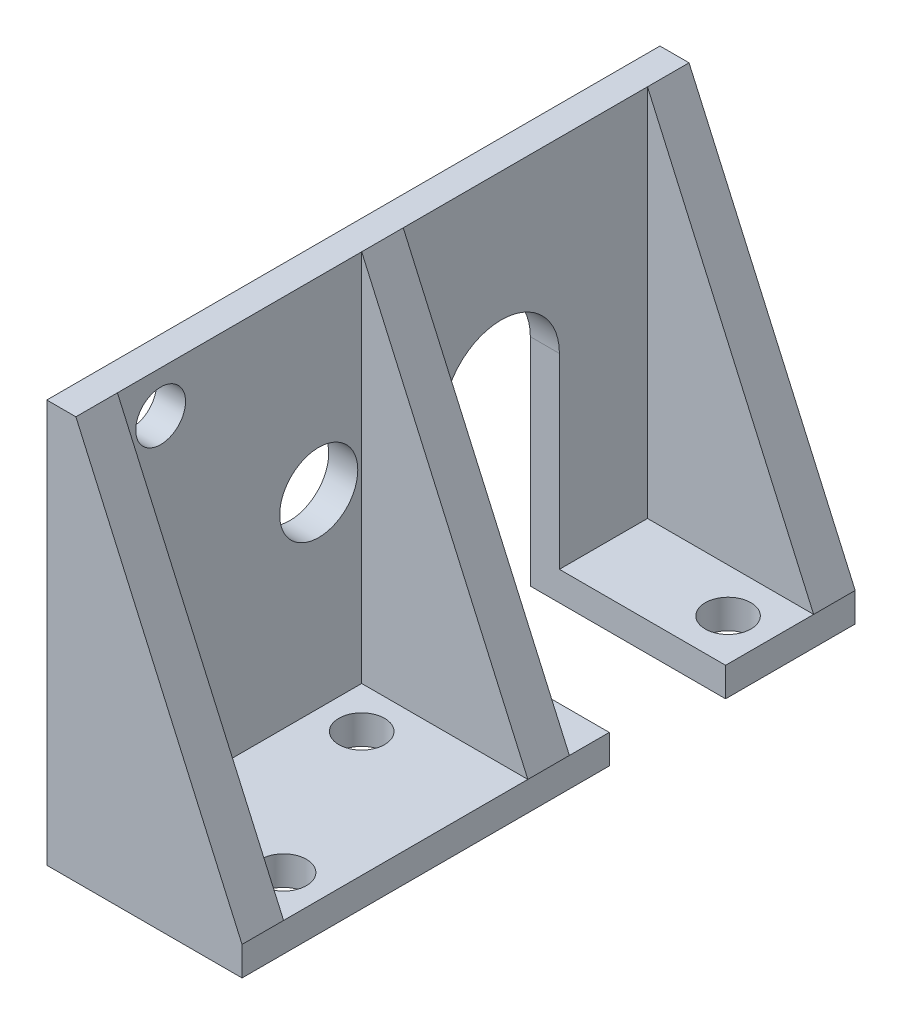
ISO-10303-21;
HEADER;
FILE_DESCRIPTION(('STEP AP214'),'2;1');
FILE_NAME('part.step','',(''),(''),'','','');
FILE_SCHEMA(('AUTOMOTIVE_DESIGN { 1 0 10303 214 1 1 1 1 }'));
ENDSEC;
DATA;
#1=APPLICATION_CONTEXT('core data for automotive mechanical design processes');
#2=APPLICATION_PROTOCOL_DEFINITION('international standard','automotive_design',2000,#1);
#3=PRODUCT_CONTEXT('',#1,'mechanical');
#4=PRODUCT('Part','Part','',(#3));
#5=PRODUCT_RELATED_PRODUCT_CATEGORY('part','',(#4));
#6=PRODUCT_DEFINITION_FORMATION('','',#4);
#7=PRODUCT_DEFINITION_CONTEXT('part definition',#1,'design');
#8=PRODUCT_DEFINITION('design','',#6,#7);
#9=PRODUCT_DEFINITION_SHAPE('','',#8);
#10=(LENGTH_UNIT() NAMED_UNIT(*) SI_UNIT(.MILLI.,.METRE.));
#11=(NAMED_UNIT(*) PLANE_ANGLE_UNIT() SI_UNIT($,.RADIAN.));
#12=(NAMED_UNIT(*) SI_UNIT($,.STERADIAN.) SOLID_ANGLE_UNIT());
#13=UNCERTAINTY_MEASURE_WITH_UNIT(LENGTH_MEASURE(1.E-05),#10,'distance_accuracy_value','');
#14=(GEOMETRIC_REPRESENTATION_CONTEXT(3) GLOBAL_UNCERTAINTY_ASSIGNED_CONTEXT((#13)) GLOBAL_UNIT_ASSIGNED_CONTEXT((#10,
#11,#12)) REPRESENTATION_CONTEXT('',''));
#15=CARTESIAN_POINT('',(0.,0.,0.));
#16=DIRECTION('',(0.,0.,1.));
#17=DIRECTION('',(1.,0.,0.));
#18=AXIS2_PLACEMENT_3D('',#15,#16,#17);
#19=CARTESIAN_POINT('',(0.,0.,0.));
#20=DIRECTION('',(0.,-1.,0.));
#21=DIRECTION('',(0.,0.,-1.));
#22=AXIS2_PLACEMENT_3D('',#19,#20,#21);
#23=PLANE('',#22);
#24=DIRECTION('',(0.,0.,1.));
#25=VECTOR('',#24,1.);
#26=CARTESIAN_POINT('',(11.75,0.,0.));
#27=LINE('',#26,#25);
#28=CARTESIAN_POINT('',(11.75,0.,-22.1));
#29=VERTEX_POINT('',#28);
#30=CARTESIAN_POINT('',(11.75,0.,-19.7));
#31=VERTEX_POINT('',#30);
#32=EDGE_CURVE('E330',#29,#31,#27,.T.);
#33=ORIENTED_EDGE('',*,*,#32,.F.);
#34=DIRECTION('',(-1.,0.,0.));
#35=VECTOR('',#34,1.);
#36=CARTESIAN_POINT('',(0.,0.,-22.1));
#37=LINE('',#36,#35);
#38=CARTESIAN_POINT('',(1.75,0.,-22.1));
#39=VERTEX_POINT('',#38);
#40=EDGE_CURVE('E226',#29,#39,#37,.T.);
#41=ORIENTED_EDGE('',*,*,#40,.T.);
#42=DIRECTION('',(0.,0.,-1.));
#43=VECTOR('',#42,1.);
#44=CARTESIAN_POINT('',(1.75,0.,0.));
#45=LINE('',#44,#43);
#46=CARTESIAN_POINT('',(1.75,0.,-19.7));
#47=VERTEX_POINT('',#46);
#48=EDGE_CURVE('E344',#47,#39,#45,.T.);
#49=ORIENTED_EDGE('',*,*,#48,.F.);
#50=DIRECTION('',(-1.,0.,0.));
#51=VECTOR('',#50,1.);
#52=CARTESIAN_POINT('',(0.,0.,-19.7));
#53=LINE('',#52,#51);
#54=EDGE_CURVE('E256',#31,#47,#53,.T.);
#55=ORIENTED_EDGE('',*,*,#54,.F.);
#56=EDGE_LOOP('',(#33,#41,#49,#55));
#57=FACE_BOUND('',#56,.T.);
#58=ADVANCED_FACE('F50',(#57),#23,.F.);
#59=CARTESIAN_POINT('',(11.75,-1.75,0.));
#60=DIRECTION('',(-1.,0.,0.));
#61=DIRECTION('',(0.,0.,1.));
#62=AXIS2_PLACEMENT_3D('',#59,#60,#61);
#63=PLANE('',#62);
#64=DIRECTION('',(0.,0.,1.));
#65=VECTOR('',#64,1.);
#66=CARTESIAN_POINT('',(11.75,-1.75,0.));
#67=LINE('',#66,#65);
#68=CARTESIAN_POINT('',(11.75,-1.75,-22.1));
#69=VERTEX_POINT('',#68);
#70=CARTESIAN_POINT('',(11.75,-1.75,0.));
#71=VERTEX_POINT('',#70);
#72=EDGE_CURVE('E315',#69,#71,#67,.T.);
#73=ORIENTED_EDGE('',*,*,#72,.F.);
#74=DIRECTION('',(0.,-1.,0.));
#75=VECTOR('',#74,1.);
#76=CARTESIAN_POINT('',(11.75,-1.75,-22.1));
#77=LINE('',#76,#75);
#78=EDGE_CURVE('E197',#29,#69,#77,.T.);
#79=ORIENTED_EDGE('',*,*,#78,.F.);
#80=ORIENTED_EDGE('',*,*,#32,.T.);
#81=CARTESIAN_POINT('',(11.75,0.,-17.2));
#82=VERTEX_POINT('',#81);
#83=EDGE_CURVE('E420',#31,#82,#27,.T.);
#84=ORIENTED_EDGE('',*,*,#83,.T.);
#85=CARTESIAN_POINT('',(11.75,0.,-2.5));
#86=VERTEX_POINT('',#85);
#87=EDGE_CURVE('E416',#82,#86,#27,.T.);
#88=ORIENTED_EDGE('',*,*,#87,.T.);
#89=CARTESIAN_POINT('',(11.75,0.,0.));
#90=VERTEX_POINT('',#89);
#91=EDGE_CURVE('E307',#86,#90,#27,.T.);
#92=ORIENTED_EDGE('',*,*,#91,.T.);
#93=DIRECTION('',(0.,1.,0.));
#94=VECTOR('',#93,1.);
#95=CARTESIAN_POINT('',(11.75,-1.75,0.));
#96=LINE('',#95,#94);
#97=EDGE_CURVE('E324',#71,#90,#96,.T.);
#98=ORIENTED_EDGE('',*,*,#97,.F.);
#99=EDGE_LOOP('',(#73,#79,#80,#84,#88,#92,#98));
#100=FACE_BOUND('',#99,.T.);
#101=ADVANCED_FACE('F386',(#100),#63,.F.);
#102=CARTESIAN_POINT('',(0.,-1.75,0.));
#103=DIRECTION('',(0.,-1.,0.));
#104=DIRECTION('',(0.,0.,-1.));
#105=AXIS2_PLACEMENT_3D('',#102,#103,#104);
#106=PLANE('',#105);
#107=CARTESIAN_POINT('',(9.25,-1.75,-5.));
#108=DIRECTION('',(0.,1.,0.));
#109=DIRECTION('',(0.,0.,1.));
#110=AXIS2_PLACEMENT_3D('',#107,#108,#109);
#111=CIRCLE('',#110,1.375);
#112=CARTESIAN_POINT('',(9.25,-1.75,-3.625));
#113=VERTEX_POINT('',#112);
#114=EDGE_CURVE('E210',#113,#113,#111,.T.);
#115=ORIENTED_EDGE('',*,*,#114,.T.);
#116=EDGE_LOOP('',(#115));
#117=FACE_BOUND('',#116,.T.);
#118=CARTESIAN_POINT('',(4.25,-1.75,-14.7));
#119=DIRECTION('',(0.,1.,0.));
#120=DIRECTION('',(0.,0.,1.));
#121=AXIS2_PLACEMENT_3D('',#118,#119,#120);
#122=CIRCLE('',#121,1.375);
#123=CARTESIAN_POINT('',(4.25,-1.75,-13.325));
#124=VERTEX_POINT('',#123);
#125=EDGE_CURVE('E513',#124,#124,#122,.T.);
#126=ORIENTED_EDGE('',*,*,#125,.T.);
#127=EDGE_LOOP('',(#126));
#128=FACE_BOUND('',#127,.T.);
#129=DIRECTION('',(1.,0.,0.));
#130=VECTOR('',#129,1.);
#131=CARTESIAN_POINT('',(0.,-1.75,-22.1));
#132=LINE('',#131,#130);
#133=CARTESIAN_POINT('',(0.,-1.75,-22.1));
#134=VERTEX_POINT('',#133);
#135=EDGE_CURVE('E212',#134,#69,#132,.T.);
#136=ORIENTED_EDGE('',*,*,#135,.T.);
#137=ORIENTED_EDGE('',*,*,#72,.T.);
#138=DIRECTION('',(-1.,0.,0.));
#139=VECTOR('',#138,1.);
#140=CARTESIAN_POINT('',(0.,-1.75,0.));
#141=LINE('',#140,#139);
#142=CARTESIAN_POINT('',(0.,-1.75,0.));
#143=VERTEX_POINT('',#142);
#144=EDGE_CURVE('E320',#71,#143,#141,.T.);
#145=ORIENTED_EDGE('',*,*,#144,.T.);
#146=DIRECTION('',(0.,0.,-1.));
#147=VECTOR('',#146,1.);
#148=CARTESIAN_POINT('',(0.,-1.75,0.));
#149=LINE('',#148,#147);
#150=EDGE_CURVE('E308',#143,#134,#149,.T.);
#151=ORIENTED_EDGE('',*,*,#150,.T.);
#152=EDGE_LOOP('',(#136,#137,#145,#151));
#153=FACE_BOUND('',#152,.T.);
#154=ADVANCED_FACE('F380',(#117,#128,#153),#106,.T.);
#155=CARTESIAN_POINT('',(1.75,0.,0.));
#156=DIRECTION('',(-1.,0.,0.));
#157=DIRECTION('',(0.,0.,1.));
#158=AXIS2_PLACEMENT_3D('',#155,#156,#157);
#159=PLANE('',#158);
#160=ORIENTED_EDGE('',*,*,#48,.T.);
#161=DIRECTION('',(0.,1.,0.));
#162=VECTOR('',#161,1.);
#163=CARTESIAN_POINT('',(1.75,0.,-22.1));
#164=LINE('',#163,#162);
#165=CARTESIAN_POINT('',(1.75,11.25,-22.1));
#166=VERTEX_POINT('',#165);
#167=EDGE_CURVE('E230',#39,#166,#164,.T.);
#168=ORIENTED_EDGE('',*,*,#167,.T.);
#169=CARTESIAN_POINT('',(1.75,11.25,-25.6));
#170=DIRECTION('',(-1.,0.,0.));
#171=DIRECTION('',(0.,0.,1.));
#172=AXIS2_PLACEMENT_3D('',#169,#170,#171);
#173=CIRCLE('',#172,3.5);
#174=CARTESIAN_POINT('',(1.75,11.25,-29.1));
#175=VERTEX_POINT('',#174);
#176=EDGE_CURVE('E234',#166,#175,#173,.T.);
#177=ORIENTED_EDGE('',*,*,#176,.T.);
#178=DIRECTION('',(0.,-1.,0.));
#179=VECTOR('',#178,1.);
#180=CARTESIAN_POINT('',(1.75,0.,-29.1));
#181=LINE('',#180,#179);
#182=CARTESIAN_POINT('',(1.75,0.,-29.1));
#183=VERTEX_POINT('',#182);
#184=EDGE_CURVE('E174',#175,#183,#181,.T.);
#185=ORIENTED_EDGE('',*,*,#184,.T.);
#186=CARTESIAN_POINT('',(1.75,0.,-34.4));
#187=VERTEX_POINT('',#186);
#188=EDGE_CURVE('E345',#183,#187,#45,.T.);
#189=ORIENTED_EDGE('',*,*,#188,.T.);
#190=DIRECTION('',(0.,-1.,0.));
#191=VECTOR('',#190,1.);
#192=CARTESIAN_POINT('',(1.75,0.,-34.4));
#193=LINE('',#192,#191);
#194=CARTESIAN_POINT('',(1.75,22.5,-34.4));
#195=VERTEX_POINT('',#194);
#196=EDGE_CURVE('E287',#195,#187,#193,.T.);
#197=ORIENTED_EDGE('',*,*,#196,.F.);
#198=DIRECTION('',(0.,0.,1.));
#199=VECTOR('',#198,1.);
#200=CARTESIAN_POINT('',(1.75,22.5,0.));
#201=LINE('',#200,#199);
#202=CARTESIAN_POINT('',(1.75,22.5,-19.7));
#203=VERTEX_POINT('',#202);
#204=EDGE_CURVE('E350',#195,#203,#201,.T.);
#205=ORIENTED_EDGE('',*,*,#204,.T.);
#206=DIRECTION('',(0.,1.,0.));
#207=VECTOR('',#206,1.);
#208=CARTESIAN_POINT('',(1.75,0.,-19.7));
#209=LINE('',#208,#207);
#210=EDGE_CURVE('E262',#47,#203,#209,.T.);
#211=ORIENTED_EDGE('',*,*,#210,.F.);
#212=EDGE_LOOP('',(#160,#168,#177,#185,#189,#197,#205,#211));
#213=FACE_BOUND('',#212,.T.);
#214=ADVANCED_FACE('F408',(#213),#159,.F.);
#215=CARTESIAN_POINT('',(9.25000000000001,0.,-31.75));
#216=DIRECTION('',(0.,1.,0.));
#217=DIRECTION('',(0.,0.,1.));
#218=AXIS2_PLACEMENT_3D('',#215,#216,#217);
#219=CIRCLE('',#218,1.375);
#220=CARTESIAN_POINT('',(9.25000000000001,0.,-30.375));
#221=VERTEX_POINT('',#220);
#222=EDGE_CURVE('E204',#221,#221,#219,.T.);
#223=ORIENTED_EDGE('',*,*,#222,.F.);
#224=EDGE_LOOP('',(#223));
#225=FACE_BOUND('',#224,.T.);
#226=ORIENTED_EDGE('',*,*,#188,.F.);
#227=DIRECTION('',(1.,0.,0.));
#228=VECTOR('',#227,1.);
#229=CARTESIAN_POINT('',(0.,0.,-29.1));
#230=LINE('',#229,#228);
#231=CARTESIAN_POINT('',(11.75,0.,-29.1));
#232=VERTEX_POINT('',#231);
#233=EDGE_CURVE('E216',#183,#232,#230,.T.);
#234=ORIENTED_EDGE('',*,*,#233,.T.);
#235=CARTESIAN_POINT('',(11.75,0.,-34.4));
#236=VERTEX_POINT('',#235);
#237=EDGE_CURVE('E329',#236,#232,#27,.T.);
#238=ORIENTED_EDGE('',*,*,#237,.F.);
#239=DIRECTION('',(1.,0.,0.));
#240=VECTOR('',#239,1.);
#241=CARTESIAN_POINT('',(0.,0.,-34.4));
#242=LINE('',#241,#240);
#243=EDGE_CURVE('E281',#187,#236,#242,.T.);
#244=ORIENTED_EDGE('',*,*,#243,.F.);
#245=EDGE_LOOP('',(#226,#234,#238,#244));
#246=FACE_BOUND('',#245,.T.);
#247=ADVANCED_FACE('F469',(#225,#246),#23,.F.);
#248=CARTESIAN_POINT('',(1.75,11.25,-14.615));
#249=DIRECTION('',(1.,0.,0.));
#250=DIRECTION('',(0.,0.,-1.));
#251=AXIS2_PLACEMENT_3D('',#248,#249,#250);
#252=CIRCLE('',#251,2.35);
#253=CARTESIAN_POINT('',(1.75,11.25,-16.965));
#254=VERTEX_POINT('',#253);
#255=EDGE_CURVE('E528',#254,#254,#252,.T.);
#256=ORIENTED_EDGE('',*,*,#255,.F.);
#257=EDGE_LOOP('',(#256));
#258=FACE_BOUND('',#257,.T.);
#259=CARTESIAN_POINT('',(1.75,2.5,-5.09999999999999));
#260=DIRECTION('',(1.,0.,0.));
#261=DIRECTION('',(0.,0.,-1.));
#262=AXIS2_PLACEMENT_3D('',#259,#260,#261);
#263=CIRCLE('',#262,1.5);
#264=CARTESIAN_POINT('',(1.75,2.5,-6.59999999999999));
#265=VERTEX_POINT('',#264);
#266=EDGE_CURVE('E243',#265,#265,#263,.T.);
#267=ORIENTED_EDGE('',*,*,#266,.F.);
#268=EDGE_LOOP('',(#267));
#269=FACE_BOUND('',#268,.T.);
#270=CARTESIAN_POINT('',(1.75,20.,-5.09999999999999));
#271=DIRECTION('',(1.,0.,0.));
#272=DIRECTION('',(0.,0.,-1.));
#273=AXIS2_PLACEMENT_3D('',#270,#271,#272);
#274=CIRCLE('',#273,1.5);
#275=CARTESIAN_POINT('',(1.75,20.,-6.59999999999999));
#276=VERTEX_POINT('',#275);
#277=EDGE_CURVE('E237',#276,#276,#274,.T.);
#278=ORIENTED_EDGE('',*,*,#277,.F.);
#279=EDGE_LOOP('',(#278));
#280=FACE_BOUND('',#279,.T.);
#281=CARTESIAN_POINT('',(1.75,0.,-2.5));
#282=VERTEX_POINT('',#281);
#283=CARTESIAN_POINT('',(1.75,0.,-17.2));
#284=VERTEX_POINT('',#283);
#285=EDGE_CURVE('E339',#282,#284,#45,.T.);
#286=ORIENTED_EDGE('',*,*,#285,.T.);
#287=DIRECTION('',(0.,1.,0.));
#288=VECTOR('',#287,1.);
#289=CARTESIAN_POINT('',(1.75,0.,-17.2));
#290=LINE('',#289,#288);
#291=CARTESIAN_POINT('',(1.75,22.5,-17.2));
#292=VERTEX_POINT('',#291);
#293=EDGE_CURVE('E269',#284,#292,#290,.T.);
#294=ORIENTED_EDGE('',*,*,#293,.T.);
#295=CARTESIAN_POINT('',(1.75,22.5,-2.5));
#296=VERTEX_POINT('',#295);
#297=EDGE_CURVE('E343',#292,#296,#201,.T.);
#298=ORIENTED_EDGE('',*,*,#297,.T.);
#299=DIRECTION('',(0.,1.,0.));
#300=VECTOR('',#299,1.);
#301=CARTESIAN_POINT('',(1.75,0.,-2.5));
#302=LINE('',#301,#300);
#303=EDGE_CURVE('E296',#282,#296,#302,.T.);
#304=ORIENTED_EDGE('',*,*,#303,.F.);
#305=EDGE_LOOP('',(#286,#294,#298,#304));
#306=FACE_BOUND('',#305,.T.);
#307=ADVANCED_FACE('F398',(#258,#269,#280,#306),#159,.F.);
#308=CARTESIAN_POINT('',(9.25,0.,-5.));
#309=DIRECTION('',(0.,1.,0.));
#310=DIRECTION('',(0.,0.,1.));
#311=AXIS2_PLACEMENT_3D('',#308,#309,#310);
#312=CIRCLE('',#311,1.375);
#313=CARTESIAN_POINT('',(9.25,0.,-3.625));
#314=VERTEX_POINT('',#313);
#315=EDGE_CURVE('E507',#314,#314,#312,.T.);
#316=ORIENTED_EDGE('',*,*,#315,.F.);
#317=EDGE_LOOP('',(#316));
#318=FACE_BOUND('',#317,.T.);
#319=CARTESIAN_POINT('',(4.25,0.,-14.7));
#320=DIRECTION('',(0.,1.,0.));
#321=DIRECTION('',(0.,0.,1.));
#322=AXIS2_PLACEMENT_3D('',#319,#320,#321);
#323=CIRCLE('',#322,1.375);
#324=CARTESIAN_POINT('',(4.25,0.,-13.325));
#325=VERTEX_POINT('',#324);
#326=EDGE_CURVE('E510',#325,#325,#323,.T.);
#327=ORIENTED_EDGE('',*,*,#326,.F.);
#328=EDGE_LOOP('',(#327));
#329=FACE_BOUND('',#328,.T.);
#330=ORIENTED_EDGE('',*,*,#87,.F.);
#331=DIRECTION('',(-1.,0.,0.));
#332=VECTOR('',#331,1.);
#333=CARTESIAN_POINT('',(0.,0.,-17.2));
#334=LINE('',#333,#332);
#335=EDGE_CURVE('E265',#82,#284,#334,.T.);
#336=ORIENTED_EDGE('',*,*,#335,.T.);
#337=ORIENTED_EDGE('',*,*,#285,.F.);
#338=DIRECTION('',(-1.,0.,0.));
#339=VECTOR('',#338,1.);
#340=CARTESIAN_POINT('',(0.,0.,-2.5));
#341=LINE('',#340,#339);
#342=EDGE_CURVE('E13',#86,#282,#341,.T.);
#343=ORIENTED_EDGE('',*,*,#342,.F.);
#344=EDGE_LOOP('',(#330,#336,#337,#343));
#345=FACE_BOUND('',#344,.T.);
#346=ADVANCED_FACE('F418',(#318,#329,#345),#23,.F.);
#347=CARTESIAN_POINT('',(1.75,0.,0.));
#348=DIRECTION('',(0.,0.,-1.));
#349=DIRECTION('',(-1.,0.,0.));
#350=AXIS2_PLACEMENT_3D('',#347,#348,#349);
#351=PLANE('',#350);
#352=DIRECTION('',(0.,-1.,0.));
#353=VECTOR('',#352,1.);
#354=CARTESIAN_POINT('',(0.,0.,0.));
#355=LINE('',#354,#353);
#356=CARTESIAN_POINT('',(0.,22.5,0.));
#357=VERTEX_POINT('',#356);
#358=EDGE_CURVE('E338',#357,#143,#355,.T.);
#359=ORIENTED_EDGE('',*,*,#358,.T.);
#360=ORIENTED_EDGE('',*,*,#144,.F.);
#361=ORIENTED_EDGE('',*,*,#97,.T.);
#362=DIRECTION('',(0.406138466053448,-0.913811548620257,0.));
#363=VECTOR('',#362,1.);
#364=CARTESIAN_POINT('',(1.75,22.5,0.));
#365=LINE('',#364,#363);
#366=CARTESIAN_POINT('',(1.75,22.5,0.));
#367=VERTEX_POINT('',#366);
#368=EDGE_CURVE('E292',#367,#90,#365,.T.);
#369=ORIENTED_EDGE('',*,*,#368,.F.);
#370=DIRECTION('',(-1.,0.,0.));
#371=VECTOR('',#370,1.);
#372=CARTESIAN_POINT('',(1.75,22.5,0.));
#373=LINE('',#372,#371);
#374=EDGE_CURVE('E349',#367,#357,#373,.T.);
#375=ORIENTED_EDGE('',*,*,#374,.T.);
#376=EDGE_LOOP('',(#359,#360,#361,#369,#375));
#377=FACE_BOUND('',#376,.T.);
#378=ADVANCED_FACE('F52',(#377),#351,.F.);
#379=CARTESIAN_POINT('',(1.75,0.,-36.9));
#380=DIRECTION('',(0.,0.,1.));
#381=DIRECTION('',(1.,0.,0.));
#382=AXIS2_PLACEMENT_3D('',#379,#380,#381);
#383=PLANE('',#382);
#384=DIRECTION('',(-1.,0.,0.));
#385=VECTOR('',#384,1.);
#386=CARTESIAN_POINT('',(1.75,22.5,-36.9));
#387=LINE('',#386,#385);
#388=CARTESIAN_POINT('',(1.75,22.5,-36.9));
#389=VERTEX_POINT('',#388);
#390=CARTESIAN_POINT('',(0.,22.5,-36.9));
#391=VERTEX_POINT('',#390);
#392=EDGE_CURVE('E60',#389,#391,#387,.T.);
#393=ORIENTED_EDGE('',*,*,#392,.F.);
#394=DIRECTION('',(0.406138466053448,-0.913811548620257,0.));
#395=VECTOR('',#394,1.);
#396=CARTESIAN_POINT('',(1.75,22.5,-36.9));
#397=LINE('',#396,#395);
#398=CARTESIAN_POINT('',(11.75,0.,-36.9));
#399=VERTEX_POINT('',#398);
#400=EDGE_CURVE('E277',#389,#399,#397,.T.);
#401=ORIENTED_EDGE('',*,*,#400,.T.);
#402=DIRECTION('',(0.,1.,0.));
#403=VECTOR('',#402,1.);
#404=CARTESIAN_POINT('',(11.75,-1.75,-36.9));
#405=LINE('',#404,#403);
#406=CARTESIAN_POINT('',(11.75,-1.75,-36.9));
#407=VERTEX_POINT('',#406);
#408=EDGE_CURVE('E334',#407,#399,#405,.T.);
#409=ORIENTED_EDGE('',*,*,#408,.F.);
#410=DIRECTION('',(1.,0.,0.));
#411=VECTOR('',#410,1.);
#412=CARTESIAN_POINT('',(0.,-1.75,-36.9));
#413=LINE('',#412,#411);
#414=CARTESIAN_POINT('',(0.,-1.75,-36.9));
#415=VERTEX_POINT('',#414);
#416=EDGE_CURVE('E312',#415,#407,#413,.T.);
#417=ORIENTED_EDGE('',*,*,#416,.F.);
#418=DIRECTION('',(0.,1.,0.));
#419=VECTOR('',#418,1.);
#420=CARTESIAN_POINT('',(0.,0.,-36.9));
#421=LINE('',#420,#419);
#422=EDGE_CURVE('E353',#415,#391,#421,.T.);
#423=ORIENTED_EDGE('',*,*,#422,.T.);
#424=EDGE_LOOP('',(#393,#401,#409,#417,#423));
#425=FACE_BOUND('',#424,.T.);
#426=ADVANCED_FACE('F501',(#425),#383,.F.);
#427=CARTESIAN_POINT('',(1.75,22.5,0.));
#428=DIRECTION('',(0.,-1.,0.));
#429=DIRECTION('',(0.,0.,-1.));
#430=AXIS2_PLACEMENT_3D('',#427,#428,#429);
#431=PLANE('',#430);
#432=ORIENTED_EDGE('',*,*,#297,.F.);
#433=DIRECTION('',(0.,0.,-1.));
#434=VECTOR('',#433,1.);
#435=CARTESIAN_POINT('',(1.75,22.5,0.));
#436=LINE('',#435,#434);
#437=EDGE_CURVE('E273',#203,#292,#436,.F.);
#438=ORIENTED_EDGE('',*,*,#437,.F.);
#439=ORIENTED_EDGE('',*,*,#204,.F.);
#440=EDGE_CURVE('E346',#389,#195,#201,.T.);
#441=ORIENTED_EDGE('',*,*,#440,.F.);
#442=ORIENTED_EDGE('',*,*,#392,.T.);
#443=DIRECTION('',(0.,0.,1.));
#444=VECTOR('',#443,1.);
#445=CARTESIAN_POINT('',(0.,22.5,0.));
#446=LINE('',#445,#444);
#447=EDGE_CURVE('E356',#391,#357,#446,.T.);
#448=ORIENTED_EDGE('',*,*,#447,.T.);
#449=ORIENTED_EDGE('',*,*,#374,.F.);
#450=DIRECTION('',(0.,0.,1.));
#451=VECTOR('',#450,1.);
#452=CARTESIAN_POINT('',(1.75,22.5,0.));
#453=LINE('',#452,#451);
#454=EDGE_CURVE('E303',#367,#296,#453,.F.);
#455=ORIENTED_EDGE('',*,*,#454,.T.);
#456=EDGE_LOOP('',(#432,#438,#439,#441,#442,#448,#449,#455));
#457=FACE_BOUND('',#456,.T.);
#458=ADVANCED_FACE('F370',(#457),#431,.F.);
#459=CARTESIAN_POINT('',(0.,0.,0.));
#460=DIRECTION('',(-1.,0.,0.));
#461=DIRECTION('',(0.,0.,1.));
#462=AXIS2_PLACEMENT_3D('',#459,#460,#461);
#463=PLANE('',#462);
#464=CARTESIAN_POINT('',(0.,11.25,-14.615));
#465=DIRECTION('',(-1.,0.,0.));
#466=DIRECTION('',(0.,0.,1.));
#467=AXIS2_PLACEMENT_3D('',#464,#465,#466);
#468=CIRCLE('',#467,2.35);
#469=CARTESIAN_POINT('',(0.,11.25,-12.265));
#470=VERTEX_POINT('',#469);
#471=EDGE_CURVE('E54',#470,#470,#468,.T.);
#472=ORIENTED_EDGE('',*,*,#471,.F.);
#473=EDGE_LOOP('',(#472));
#474=FACE_BOUND('',#473,.T.);
#475=DIRECTION('',(0.,-1.,0.));
#476=VECTOR('',#475,1.);
#477=CARTESIAN_POINT('',(0.,-1.75,-22.1));
#478=LINE('',#477,#476);
#479=CARTESIAN_POINT('',(0.,11.25,-22.1));
#480=VERTEX_POINT('',#479);
#481=EDGE_CURVE('E189',#480,#134,#478,.T.);
#482=ORIENTED_EDGE('',*,*,#481,.T.);
#483=ORIENTED_EDGE('',*,*,#150,.F.);
#484=ORIENTED_EDGE('',*,*,#358,.F.);
#485=ORIENTED_EDGE('',*,*,#447,.F.);
#486=ORIENTED_EDGE('',*,*,#422,.F.);
#487=CARTESIAN_POINT('',(0.,-1.75,-29.1));
#488=VERTEX_POINT('',#487);
#489=EDGE_CURVE('E195',#488,#415,#149,.T.);
#490=ORIENTED_EDGE('',*,*,#489,.F.);
#491=DIRECTION('',(0.,1.,0.));
#492=VECTOR('',#491,1.);
#493=CARTESIAN_POINT('',(0.,-1.75,-29.1));
#494=LINE('',#493,#492);
#495=CARTESIAN_POINT('',(0.,11.25,-29.1));
#496=VERTEX_POINT('',#495);
#497=EDGE_CURVE('E67',#488,#496,#494,.T.);
#498=ORIENTED_EDGE('',*,*,#497,.T.);
#499=CARTESIAN_POINT('',(0.,11.25,-25.6));
#500=DIRECTION('',(1.,0.,0.));
#501=DIRECTION('',(0.,0.,-1.));
#502=AXIS2_PLACEMENT_3D('',#499,#500,#501);
#503=CIRCLE('',#502,3.5);
#504=EDGE_CURVE('E182',#496,#480,#503,.T.);
#505=ORIENTED_EDGE('',*,*,#504,.T.);
#506=EDGE_LOOP('',(#482,#483,#484,#485,#486,#490,#498,#505));
#507=FACE_BOUND('',#506,.T.);
#508=CARTESIAN_POINT('',(0.,2.5,-5.09999999999999));
#509=DIRECTION('',(1.,0.,0.));
#510=DIRECTION('',(0.,0.,-1.));
#511=AXIS2_PLACEMENT_3D('',#508,#509,#510);
#512=CIRCLE('',#511,1.5);
#513=CARTESIAN_POINT('',(0.,2.5,-6.59999999999999));
#514=VERTEX_POINT('',#513);
#515=EDGE_CURVE('E238',#514,#514,#512,.T.);
#516=ORIENTED_EDGE('',*,*,#515,.T.);
#517=EDGE_LOOP('',(#516));
#518=FACE_BOUND('',#517,.T.);
#519=CARTESIAN_POINT('',(0.,20.,-5.09999999999999));
#520=DIRECTION('',(1.,0.,0.));
#521=DIRECTION('',(0.,0.,-1.));
#522=AXIS2_PLACEMENT_3D('',#519,#520,#521);
#523=CIRCLE('',#522,1.5);
#524=CARTESIAN_POINT('',(0.,20.,-6.59999999999999));
#525=VERTEX_POINT('',#524);
#526=EDGE_CURVE('E247',#525,#525,#523,.T.);
#527=ORIENTED_EDGE('',*,*,#526,.T.);
#528=EDGE_LOOP('',(#527));
#529=FACE_BOUND('',#528,.T.);
#530=ADVANCED_FACE('F192',(#474,#507,#518,#529),#463,.T.);
#531=ORIENTED_EDGE('',*,*,#237,.T.);
#532=DIRECTION('',(0.,1.,0.));
#533=VECTOR('',#532,1.);
#534=CARTESIAN_POINT('',(11.75,-1.75,-29.1));
#535=LINE('',#534,#533);
#536=CARTESIAN_POINT('',(11.75,-1.75,-29.1));
#537=VERTEX_POINT('',#536);
#538=EDGE_CURVE('E201',#537,#232,#535,.T.);
#539=ORIENTED_EDGE('',*,*,#538,.F.);
#540=EDGE_CURVE('E316',#407,#537,#67,.T.);
#541=ORIENTED_EDGE('',*,*,#540,.F.);
#542=ORIENTED_EDGE('',*,*,#408,.T.);
#543=EDGE_CURVE('E325',#399,#236,#27,.T.);
#544=ORIENTED_EDGE('',*,*,#543,.T.);
#545=EDGE_LOOP('',(#531,#539,#541,#542,#544));
#546=FACE_BOUND('',#545,.T.);
#547=ADVANCED_FACE('F464',(#546),#63,.F.);
#548=CARTESIAN_POINT('',(9.25000000000001,-1.75,-31.75));
#549=DIRECTION('',(0.,1.,0.));
#550=DIRECTION('',(0.,0.,1.));
#551=AXIS2_PLACEMENT_3D('',#548,#549,#550);
#552=CIRCLE('',#551,1.375);
#553=CARTESIAN_POINT('',(9.25000000000001,-1.75,-30.375));
#554=VERTEX_POINT('',#553);
#555=EDGE_CURVE('E514',#554,#554,#552,.T.);
#556=ORIENTED_EDGE('',*,*,#555,.T.);
#557=EDGE_LOOP('',(#556));
#558=FACE_BOUND('',#557,.T.);
#559=DIRECTION('',(1.,0.,0.));
#560=VECTOR('',#559,1.);
#561=CARTESIAN_POINT('',(0.,-1.75,-29.1));
#562=LINE('',#561,#560);
#563=EDGE_CURVE('E179',#488,#537,#562,.T.);
#564=ORIENTED_EDGE('',*,*,#563,.F.);
#565=ORIENTED_EDGE('',*,*,#489,.T.);
#566=ORIENTED_EDGE('',*,*,#416,.T.);
#567=ORIENTED_EDGE('',*,*,#540,.T.);
#568=EDGE_LOOP('',(#564,#565,#566,#567));
#569=FACE_BOUND('',#568,.T.);
#570=ADVANCED_FACE('F584',(#558,#569),#106,.T.);
#571=CARTESIAN_POINT('',(1.75,22.5,0.));
#572=DIRECTION('',(-0.913811548620257,-0.406138466053448,0.));
#573=DIRECTION('',(0.406138466053448,-0.913811548620257,0.));
#574=AXIS2_PLACEMENT_3D('',#571,#572,#573);
#575=PLANE('',#574);
#576=ORIENTED_EDGE('',*,*,#454,.F.);
#577=ORIENTED_EDGE('',*,*,#368,.T.);
#578=ORIENTED_EDGE('',*,*,#91,.F.);
#579=DIRECTION('',(0.406138466053448,-0.913811548620257,0.));
#580=VECTOR('',#579,1.);
#581=CARTESIAN_POINT('',(1.75,22.5,-2.5));
#582=LINE('',#581,#580);
#583=EDGE_CURVE('E291',#296,#86,#582,.T.);
#584=ORIENTED_EDGE('',*,*,#583,.F.);
#585=EDGE_LOOP('',(#576,#577,#578,#584));
#586=FACE_BOUND('',#585,.T.);
#587=ADVANCED_FACE('F390',(#586),#575,.F.);
#588=CARTESIAN_POINT('',(5.875,10.375,-2.5));
#589=DIRECTION('',(0.,0.,1.));
#590=DIRECTION('',(1.,0.,0.));
#591=AXIS2_PLACEMENT_3D('',#588,#589,#590);
#592=PLANE('',#591);
#593=ORIENTED_EDGE('',*,*,#342,.T.);
#594=ORIENTED_EDGE('',*,*,#303,.T.);
#595=ORIENTED_EDGE('',*,*,#583,.T.);
#596=EDGE_LOOP('',(#593,#594,#595));
#597=FACE_BOUND('',#596,.T.);
#598=ADVANCED_FACE('F395',(#597),#592,.F.);
#599=CARTESIAN_POINT('',(5.875,10.375,-34.4));
#600=DIRECTION('',(0.,0.,-1.));
#601=DIRECTION('',(-1.,0.,0.));
#602=AXIS2_PLACEMENT_3D('',#599,#600,#601);
#603=PLANE('',#602);
#604=DIRECTION('',(0.406138466053448,-0.913811548620257,0.));
#605=VECTOR('',#604,1.);
#606=CARTESIAN_POINT('',(1.75,22.5,-34.4));
#607=LINE('',#606,#605);
#608=EDGE_CURVE('E276',#195,#236,#607,.T.);
#609=ORIENTED_EDGE('',*,*,#608,.F.);
#610=ORIENTED_EDGE('',*,*,#196,.T.);
#611=ORIENTED_EDGE('',*,*,#243,.T.);
#612=EDGE_LOOP('',(#609,#610,#611));
#613=FACE_BOUND('',#612,.T.);
#614=ADVANCED_FACE('F639',(#613),#603,.F.);
#615=CARTESIAN_POINT('',(1.75,22.5,-36.9));
#616=DIRECTION('',(0.913811548620257,0.406138466053448,0.));
#617=DIRECTION('',(0.406138466053448,-0.913811548620257,0.));
#618=AXIS2_PLACEMENT_3D('',#615,#616,#617);
#619=PLANE('',#618);
#620=ORIENTED_EDGE('',*,*,#400,.F.);
#621=ORIENTED_EDGE('',*,*,#440,.T.);
#622=ORIENTED_EDGE('',*,*,#608,.T.);
#623=ORIENTED_EDGE('',*,*,#543,.F.);
#624=EDGE_LOOP('',(#620,#621,#622,#623));
#625=FACE_BOUND('',#624,.T.);
#626=ADVANCED_FACE('F484',(#625),#619,.T.);
#627=CARTESIAN_POINT('',(5.875,10.375,-17.2));
#628=DIRECTION('',(0.,0.,1.));
#629=DIRECTION('',(1.,0.,0.));
#630=AXIS2_PLACEMENT_3D('',#627,#628,#629);
#631=PLANE('',#630);
#632=ORIENTED_EDGE('',*,*,#293,.F.);
#633=ORIENTED_EDGE('',*,*,#335,.F.);
#634=DIRECTION('',(0.406138466053448,-0.913811548620257,0.));
#635=VECTOR('',#634,1.);
#636=CARTESIAN_POINT('',(1.75,22.5,-17.2));
#637=LINE('',#636,#635);
#638=EDGE_CURVE('E75',#292,#82,#637,.T.);
#639=ORIENTED_EDGE('',*,*,#638,.F.);
#640=EDGE_LOOP('',(#632,#633,#639));
#641=FACE_BOUND('',#640,.T.);
#642=ADVANCED_FACE('F413',(#641),#631,.T.);
#643=CARTESIAN_POINT('',(5.875,10.375,-19.7));
#644=DIRECTION('',(0.,0.,1.));
#645=DIRECTION('',(1.,0.,0.));
#646=AXIS2_PLACEMENT_3D('',#643,#644,#645);
#647=PLANE('',#646);
#648=ORIENTED_EDGE('',*,*,#54,.T.);
#649=ORIENTED_EDGE('',*,*,#210,.T.);
#650=DIRECTION('',(0.406138466053448,-0.913811548620257,0.));
#651=VECTOR('',#650,1.);
#652=CARTESIAN_POINT('',(1.75,22.5,-19.7));
#653=LINE('',#652,#651);
#654=EDGE_CURVE('E242',#203,#31,#653,.T.);
#655=ORIENTED_EDGE('',*,*,#654,.T.);
#656=EDGE_LOOP('',(#648,#649,#655));
#657=FACE_BOUND('',#656,.T.);
#658=ADVANCED_FACE('F475',(#657),#647,.F.);
#659=CARTESIAN_POINT('',(1.75,22.5,-18.45));
#660=DIRECTION('',(-0.913811548620257,-0.406138466053448,0.));
#661=DIRECTION('',(0.406138466053448,-0.913811548620257,0.));
#662=AXIS2_PLACEMENT_3D('',#659,#660,#661);
#663=PLANE('',#662);
#664=ORIENTED_EDGE('',*,*,#654,.F.);
#665=ORIENTED_EDGE('',*,*,#437,.T.);
#666=ORIENTED_EDGE('',*,*,#638,.T.);
#667=ORIENTED_EDGE('',*,*,#83,.F.);
#668=EDGE_LOOP('',(#664,#665,#666,#667));
#669=FACE_BOUND('',#668,.T.);
#670=ADVANCED_FACE('F411',(#669),#663,.F.);
#671=CARTESIAN_POINT('',(0.,20.,-5.09999999999999));
#672=DIRECTION('',(1.,0.,0.));
#673=DIRECTION('',(0.,0.,-1.));
#674=AXIS2_PLACEMENT_3D('',#671,#672,#673);
#675=CYLINDRICAL_SURFACE('',#674,1.5);
#676=ORIENTED_EDGE('',*,*,#526,.F.);
#677=EDGE_LOOP('',(#676));
#678=FACE_BOUND('',#677,.T.);
#679=ORIENTED_EDGE('',*,*,#277,.T.);
#680=EDGE_LOOP('',(#679));
#681=FACE_BOUND('',#680,.T.);
#682=ADVANCED_FACE('F482',(#678,#681),#675,.F.);
#683=CARTESIAN_POINT('',(0.,2.5,-5.09999999999999));
#684=DIRECTION('',(1.,0.,0.));
#685=DIRECTION('',(0.,0.,-1.));
#686=AXIS2_PLACEMENT_3D('',#683,#684,#685);
#687=CYLINDRICAL_SURFACE('',#686,1.5);
#688=ORIENTED_EDGE('',*,*,#515,.F.);
#689=EDGE_LOOP('',(#688));
#690=FACE_BOUND('',#689,.T.);
#691=ORIENTED_EDGE('',*,*,#266,.T.);
#692=EDGE_LOOP('',(#691));
#693=FACE_BOUND('',#692,.T.);
#694=ADVANCED_FACE('F563',(#690,#693),#687,.F.);
#695=CARTESIAN_POINT('',(0.,11.25,-25.6));
#696=DIRECTION('',(1.,0.,0.));
#697=DIRECTION('',(0.,0.,-1.));
#698=AXIS2_PLACEMENT_3D('',#695,#696,#697);
#699=CYLINDRICAL_SURFACE('',#698,3.5);
#700=DIRECTION('',(1.,0.,0.));
#701=VECTOR('',#700,1.);
#702=CARTESIAN_POINT('',(0.,11.25,-22.1));
#703=LINE('',#702,#701);
#704=EDGE_CURVE('E178',#480,#166,#703,.T.);
#705=ORIENTED_EDGE('',*,*,#704,.F.);
#706=ORIENTED_EDGE('',*,*,#504,.F.);
#707=DIRECTION('',(1.,0.,0.));
#708=VECTOR('',#707,1.);
#709=CARTESIAN_POINT('',(0.,11.25,-29.1));
#710=LINE('',#709,#708);
#711=EDGE_CURVE('E170',#496,#175,#710,.T.);
#712=ORIENTED_EDGE('',*,*,#711,.T.);
#713=ORIENTED_EDGE('',*,*,#176,.F.);
#714=EDGE_LOOP('',(#705,#706,#712,#713));
#715=FACE_BOUND('',#714,.T.);
#716=ADVANCED_FACE('F183',(#715),#699,.F.);
#717=CARTESIAN_POINT('',(0.,-1.75,-22.1));
#718=DIRECTION('',(0.,0.,1.));
#719=DIRECTION('',(0.,-1.,0.));
#720=AXIS2_PLACEMENT_3D('',#717,#718,#719);
#721=PLANE('',#720);
#722=ORIENTED_EDGE('',*,*,#40,.F.);
#723=ORIENTED_EDGE('',*,*,#78,.T.);
#724=ORIENTED_EDGE('',*,*,#135,.F.);
#725=ORIENTED_EDGE('',*,*,#481,.F.);
#726=ORIENTED_EDGE('',*,*,#704,.T.);
#727=ORIENTED_EDGE('',*,*,#167,.F.);
#728=EDGE_LOOP('',(#722,#723,#724,#725,#726,#727));
#729=FACE_BOUND('',#728,.T.);
#730=ADVANCED_FACE('F471',(#729),#721,.F.);
#731=CARTESIAN_POINT('',(0.,-1.75,-29.1));
#732=DIRECTION('',(0.,0.,-1.));
#733=DIRECTION('',(-1.,0.,0.));
#734=AXIS2_PLACEMENT_3D('',#731,#732,#733);
#735=PLANE('',#734);
#736=ORIENTED_EDGE('',*,*,#711,.F.);
#737=ORIENTED_EDGE('',*,*,#497,.F.);
#738=ORIENTED_EDGE('',*,*,#563,.T.);
#739=ORIENTED_EDGE('',*,*,#538,.T.);
#740=ORIENTED_EDGE('',*,*,#233,.F.);
#741=ORIENTED_EDGE('',*,*,#184,.F.);
#742=EDGE_LOOP('',(#736,#737,#738,#739,#740,#741));
#743=FACE_BOUND('',#742,.T.);
#744=ADVANCED_FACE('F172',(#743),#735,.F.);
#745=CARTESIAN_POINT('',(9.25000000000001,-1.75,-31.75));
#746=DIRECTION('',(0.,1.,0.));
#747=DIRECTION('',(0.,0.,1.));
#748=AXIS2_PLACEMENT_3D('',#745,#746,#747);
#749=CYLINDRICAL_SURFACE('',#748,1.375);
#750=ORIENTED_EDGE('',*,*,#555,.F.);
#751=EDGE_LOOP('',(#750));
#752=FACE_BOUND('',#751,.T.);
#753=ORIENTED_EDGE('',*,*,#222,.T.);
#754=EDGE_LOOP('',(#753));
#755=FACE_BOUND('',#754,.T.);
#756=ADVANCED_FACE('F544',(#752,#755),#749,.F.);
#757=CARTESIAN_POINT('',(4.25,-1.75,-14.7));
#758=DIRECTION('',(0.,1.,0.));
#759=DIRECTION('',(0.,0.,1.));
#760=AXIS2_PLACEMENT_3D('',#757,#758,#759);
#761=CYLINDRICAL_SURFACE('',#760,1.375);
#762=ORIENTED_EDGE('',*,*,#125,.F.);
#763=EDGE_LOOP('',(#762));
#764=FACE_BOUND('',#763,.T.);
#765=ORIENTED_EDGE('',*,*,#326,.T.);
#766=EDGE_LOOP('',(#765));
#767=FACE_BOUND('',#766,.T.);
#768=ADVANCED_FACE('F546',(#764,#767),#761,.F.);
#769=CARTESIAN_POINT('',(9.25,-1.75,-5.));
#770=DIRECTION('',(0.,1.,0.));
#771=DIRECTION('',(0.,0.,1.));
#772=AXIS2_PLACEMENT_3D('',#769,#770,#771);
#773=CYLINDRICAL_SURFACE('',#772,1.375);
#774=ORIENTED_EDGE('',*,*,#114,.F.);
#775=EDGE_LOOP('',(#774));
#776=FACE_BOUND('',#775,.T.);
#777=ORIENTED_EDGE('',*,*,#315,.T.);
#778=EDGE_LOOP('',(#777));
#779=FACE_BOUND('',#778,.T.);
#780=ADVANCED_FACE('F553',(#776,#779),#773,.F.);
#781=CARTESIAN_POINT('',(-8.25,11.25,-14.615));
#782=DIRECTION('',(1.,0.,0.));
#783=DIRECTION('',(0.,0.,-1.));
#784=AXIS2_PLACEMENT_3D('',#781,#782,#783);
#785=CYLINDRICAL_SURFACE('',#784,2.35);
#786=ORIENTED_EDGE('',*,*,#471,.T.);
#787=EDGE_LOOP('',(#786));
#788=FACE_BOUND('',#787,.T.);
#789=ORIENTED_EDGE('',*,*,#255,.T.);
#790=EDGE_LOOP('',(#789));
#791=FACE_BOUND('',#790,.T.);
#792=ADVANCED_FACE('F718',(#788,#791),#785,.F.);
#793=CLOSED_SHELL('',(#58,#101,#154,#214,#247,#307,#346,#378,#426,#458,#530,#547,#570,#587,#598,
#614,#626,#642,#658,#670,#682,#694,#716,#730,#744,#756,#768,#780,#792));
#794=MANIFOLD_SOLID_BREP('B2',#793);
#795=ADVANCED_BREP_SHAPE_REPRESENTATION('',(#18,#794),#14);
#796=SHAPE_DEFINITION_REPRESENTATION(#9,#795);
ENDSEC;
END-ISO-10303-21;
